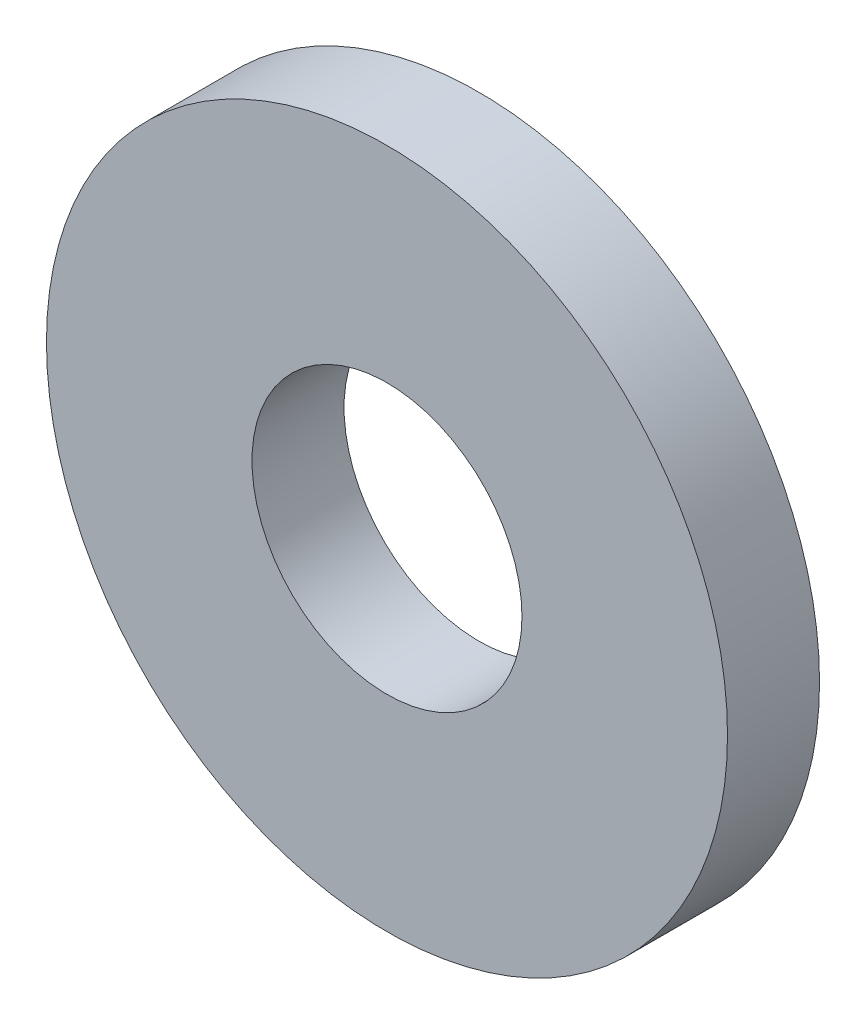
ISO-10303-21;
HEADER;
FILE_DESCRIPTION(('STEP AP214'),'2;1');
FILE_NAME('part.step','',(''),(''),'','','');
FILE_SCHEMA(('AUTOMOTIVE_DESIGN { 1 0 10303 214 1 1 1 1 }'));
ENDSEC;
DATA;
#1=APPLICATION_CONTEXT('core data for automotive mechanical design processes');
#2=APPLICATION_PROTOCOL_DEFINITION('international standard','automotive_design',2000,#1);
#3=PRODUCT_CONTEXT('',#1,'mechanical');
#4=PRODUCT('Part','Part','',(#3));
#5=PRODUCT_RELATED_PRODUCT_CATEGORY('part','',(#4));
#6=PRODUCT_DEFINITION_FORMATION('','',#4);
#7=PRODUCT_DEFINITION_CONTEXT('part definition',#1,'design');
#8=PRODUCT_DEFINITION('design','',#6,#7);
#9=PRODUCT_DEFINITION_SHAPE('','',#8);
#10=(LENGTH_UNIT() NAMED_UNIT(*) SI_UNIT(.MILLI.,.METRE.));
#11=(NAMED_UNIT(*) PLANE_ANGLE_UNIT() SI_UNIT($,.RADIAN.));
#12=(NAMED_UNIT(*) SI_UNIT($,.STERADIAN.) SOLID_ANGLE_UNIT());
#13=UNCERTAINTY_MEASURE_WITH_UNIT(LENGTH_MEASURE(1.E-05),#10,'distance_accuracy_value','');
#14=(GEOMETRIC_REPRESENTATION_CONTEXT(3) GLOBAL_UNCERTAINTY_ASSIGNED_CONTEXT((#13)) GLOBAL_UNIT_ASSIGNED_CONTEXT((#10,
#11,#12)) REPRESENTATION_CONTEXT('',''));
#15=CARTESIAN_POINT('',(0.,0.,0.));
#16=DIRECTION('',(0.,0.,1.));
#17=DIRECTION('',(1.,0.,0.));
#18=AXIS2_PLACEMENT_3D('',#15,#16,#17);
#19=CARTESIAN_POINT('',(0.,0.,1.5));
#20=DIRECTION('',(0.,0.,1.));
#21=DIRECTION('',(1.,0.,0.));
#22=AXIS2_PLACEMENT_3D('',#19,#20,#21);
#23=PLANE('',#22);
#24=CARTESIAN_POINT('',(0.,0.,1.5));
#25=DIRECTION('',(0.,0.,1.));
#26=DIRECTION('',(1.,0.,0.));
#27=AXIS2_PLACEMENT_3D('',#24,#25,#26);
#28=CIRCLE('',#27,5.55);
#29=CARTESIAN_POINT('',(5.55,0.,1.5));
#30=VERTEX_POINT('',#29);
#31=EDGE_CURVE('E10',#30,#30,#28,.T.);
#32=ORIENTED_EDGE('',*,*,#31,.T.);
#33=EDGE_LOOP('',(#32));
#34=FACE_BOUND('',#33,.T.);
#35=CARTESIAN_POINT('',(0.,0.,1.5));
#36=DIRECTION('',(0.,0.,1.));
#37=DIRECTION('',(1.,0.,0.));
#38=AXIS2_PLACEMENT_3D('',#35,#36,#37);
#39=CIRCLE('',#38,2.2);
#40=CARTESIAN_POINT('',(2.2,0.,1.5));
#41=VERTEX_POINT('',#40);
#42=EDGE_CURVE('E42',#41,#41,#39,.T.);
#43=ORIENTED_EDGE('',*,*,#42,.F.);
#44=EDGE_LOOP('',(#43));
#45=FACE_BOUND('',#44,.T.);
#46=ADVANCED_FACE('F31',(#34,#45),#23,.T.);
#47=CARTESIAN_POINT('',(0.,0.,0.));
#48=DIRECTION('',(0.,0.,1.));
#49=DIRECTION('',(1.,0.,0.));
#50=AXIS2_PLACEMENT_3D('',#47,#48,#49);
#51=PLANE('',#50);
#52=CARTESIAN_POINT('',(0.,0.,0.));
#53=DIRECTION('',(0.,0.,1.));
#54=DIRECTION('',(1.,0.,0.));
#55=AXIS2_PLACEMENT_3D('',#52,#53,#54);
#56=CIRCLE('',#55,5.55);
#57=CARTESIAN_POINT('',(5.55,0.,0.));
#58=VERTEX_POINT('',#57);
#59=EDGE_CURVE('E35',#58,#58,#56,.T.);
#60=ORIENTED_EDGE('',*,*,#59,.F.);
#61=EDGE_LOOP('',(#60));
#62=FACE_BOUND('',#61,.T.);
#63=CARTESIAN_POINT('',(0.,0.,0.));
#64=DIRECTION('',(0.,0.,1.));
#65=DIRECTION('',(1.,0.,0.));
#66=AXIS2_PLACEMENT_3D('',#63,#64,#65);
#67=CIRCLE('',#66,2.2);
#68=CARTESIAN_POINT('',(2.2,0.,0.));
#69=VERTEX_POINT('',#68);
#70=EDGE_CURVE('E44',#69,#69,#67,.T.);
#71=ORIENTED_EDGE('',*,*,#70,.T.);
#72=EDGE_LOOP('',(#71));
#73=FACE_BOUND('',#72,.T.);
#74=ADVANCED_FACE('F54',(#62,#73),#51,.F.);
#75=CARTESIAN_POINT('',(0.,0.,1.5));
#76=DIRECTION('',(0.,0.,-1.));
#77=DIRECTION('',(-1.,0.,0.));
#78=AXIS2_PLACEMENT_3D('',#75,#76,#77);
#79=CYLINDRICAL_SURFACE('',#78,5.55);
#80=ORIENTED_EDGE('',*,*,#31,.F.);
#81=EDGE_LOOP('',(#80));
#82=FACE_BOUND('',#81,.T.);
#83=ORIENTED_EDGE('',*,*,#59,.T.);
#84=EDGE_LOOP('',(#83));
#85=FACE_BOUND('',#84,.T.);
#86=ADVANCED_FACE('F33',(#82,#85),#79,.T.);
#87=CARTESIAN_POINT('',(0.,0.,1.5));
#88=DIRECTION('',(0.,0.,-1.));
#89=DIRECTION('',(-1.,0.,0.));
#90=AXIS2_PLACEMENT_3D('',#87,#88,#89);
#91=CYLINDRICAL_SURFACE('',#90,2.2);
#92=ORIENTED_EDGE('',*,*,#42,.T.);
#93=EDGE_LOOP('',(#92));
#94=FACE_BOUND('',#93,.T.);
#95=ORIENTED_EDGE('',*,*,#70,.F.);
#96=EDGE_LOOP('',(#95));
#97=FACE_BOUND('',#96,.T.);
#98=ADVANCED_FACE('F50',(#94,#97),#91,.F.);
#99=CLOSED_SHELL('',(#46,#74,#86,#98));
#100=MANIFOLD_SOLID_BREP('B2',#99);
#101=ADVANCED_BREP_SHAPE_REPRESENTATION('',(#18,#100),#14);
#102=SHAPE_DEFINITION_REPRESENTATION(#9,#101);
ENDSEC;
END-ISO-10303-21;
